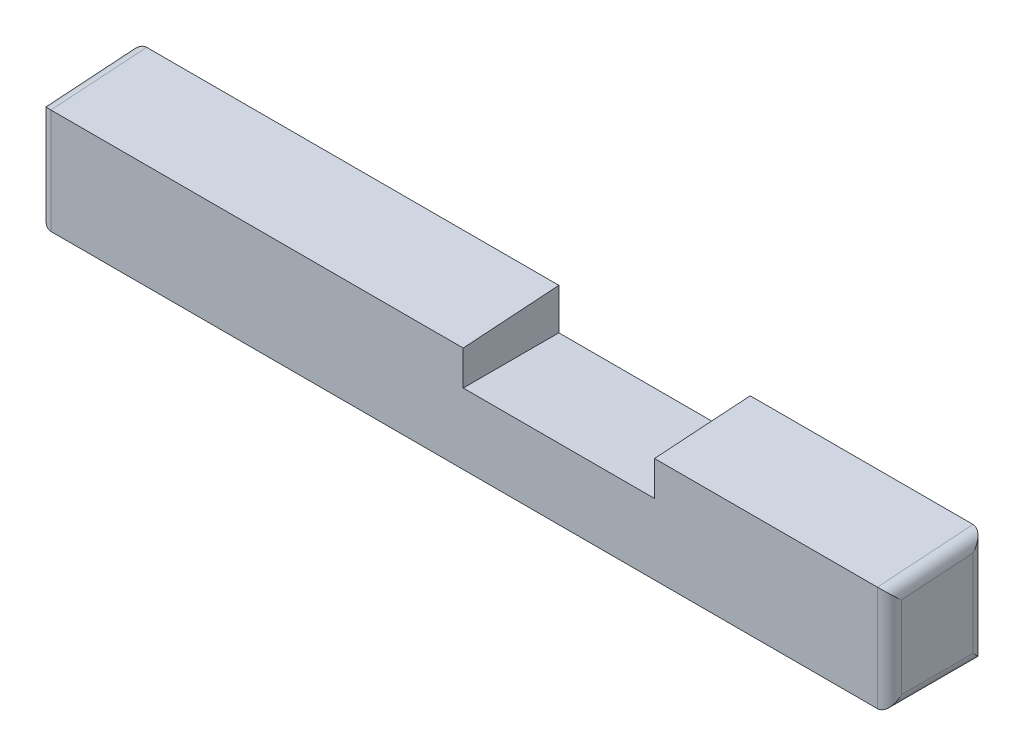
ISO-10303-21;
HEADER;
FILE_DESCRIPTION(('STEP AP214'),'2;1');
FILE_NAME('part.step','',(''),(''),'','','');
FILE_SCHEMA(('AUTOMOTIVE_DESIGN { 1 0 10303 214 1 1 1 1 }'));
ENDSEC;
DATA;
#1=APPLICATION_CONTEXT('core data for automotive mechanical design processes');
#2=APPLICATION_PROTOCOL_DEFINITION('international standard','automotive_design',2000,#1);
#3=PRODUCT_CONTEXT('',#1,'mechanical');
#4=PRODUCT('Part','Part','',(#3));
#5=PRODUCT_RELATED_PRODUCT_CATEGORY('part','',(#4));
#6=PRODUCT_DEFINITION_FORMATION('','',#4);
#7=PRODUCT_DEFINITION_CONTEXT('part definition',#1,'design');
#8=PRODUCT_DEFINITION('design','',#6,#7);
#9=PRODUCT_DEFINITION_SHAPE('','',#8);
#10=(LENGTH_UNIT() NAMED_UNIT(*) SI_UNIT(.MILLI.,.METRE.));
#11=(NAMED_UNIT(*) PLANE_ANGLE_UNIT() SI_UNIT($,.RADIAN.));
#12=(NAMED_UNIT(*) SI_UNIT($,.STERADIAN.) SOLID_ANGLE_UNIT());
#13=UNCERTAINTY_MEASURE_WITH_UNIT(LENGTH_MEASURE(1.E-05),#10,'distance_accuracy_value','');
#14=(GEOMETRIC_REPRESENTATION_CONTEXT(3) GLOBAL_UNCERTAINTY_ASSIGNED_CONTEXT((#13)) GLOBAL_UNIT_ASSIGNED_CONTEXT((#10,
#11,#12)) REPRESENTATION_CONTEXT('',''));
#15=CARTESIAN_POINT('',(0.,0.,0.));
#16=DIRECTION('',(0.,0.,1.));
#17=DIRECTION('',(1.,0.,0.));
#18=AXIS2_PLACEMENT_3D('',#15,#16,#17);
#19=CARTESIAN_POINT('',(9.25,-2.02621967336627,-1.87718698406525));
#20=DIRECTION('',(0.,-1.,0.));
#21=DIRECTION('',(0.,0.,-1.));
#22=AXIS2_PLACEMENT_3D('',#19,#20,#21);
#23=PLANE('',#22);
#24=DIRECTION('',(-1.,0.,0.));
#25=VECTOR('',#24,1.);
#26=CARTESIAN_POINT('',(9.25,-2.02621967336627,0.122813015934753));
#27=LINE('',#26,#25);
#28=CARTESIAN_POINT('',(9.,-2.02621967336627,0.122813015934753));
#29=VERTEX_POINT('',#28);
#30=CARTESIAN_POINT('',(-8.28,-2.02621967336627,0.122813015934753));
#31=VERTEX_POINT('',#30);
#32=EDGE_CURVE('E214',#29,#31,#27,.T.);
#33=ORIENTED_EDGE('',*,*,#32,.T.);
#34=DIRECTION('',(0.,0.,-1.));
#35=VECTOR('',#34,1.);
#36=CARTESIAN_POINT('',(-8.28,-2.02621967336627,-1.87718698406525));
#37=LINE('',#36,#35);
#38=CARTESIAN_POINT('',(-8.28,-2.02621967336627,-1.87718698406525));
#39=VERTEX_POINT('',#38);
#40=EDGE_CURVE('E246',#31,#39,#37,.T.);
#41=ORIENTED_EDGE('',*,*,#40,.T.);
#42=DIRECTION('',(-1.,0.,0.));
#43=VECTOR('',#42,1.);
#44=CARTESIAN_POINT('',(9.25,-2.02621967336627,-1.87718698406525));
#45=LINE('',#44,#43);
#46=CARTESIAN_POINT('',(9.,-2.02621967336627,-1.87718698406525));
#47=VERTEX_POINT('',#46);
#48=EDGE_CURVE('E218',#47,#39,#45,.T.);
#49=ORIENTED_EDGE('',*,*,#48,.F.);
#50=DIRECTION('',(0.,0.,1.));
#51=VECTOR('',#50,1.);
#52=CARTESIAN_POINT('',(9.,-2.02621967336627,-1.87718698406525));
#53=LINE('',#52,#51);
#54=EDGE_CURVE('E244',#47,#29,#53,.T.);
#55=ORIENTED_EDGE('',*,*,#54,.T.);
#56=EDGE_LOOP('',(#33,#41,#49,#55));
#57=FACE_BOUND('',#56,.T.);
#58=DIRECTION('',(1.,0.,0.));
#59=VECTOR('',#58,1.);
#60=CARTESIAN_POINT('',(-1.41,-2.02621967336627,-1.12718698406525));
#61=LINE('',#60,#59);
#62=CARTESIAN_POINT('',(-1.41,-2.02621967336627,-1.12718698406525));
#63=VERTEX_POINT('',#62);
#64=CARTESIAN_POINT('',(2.09,-2.02621967336627,-1.12718698406525));
#65=VERTEX_POINT('',#64);
#66=EDGE_CURVE('E164',#63,#65,#61,.T.);
#67=ORIENTED_EDGE('',*,*,#66,.F.);
#68=DIRECTION('',(0.,0.,-1.));
#69=VECTOR('',#68,1.);
#70=CARTESIAN_POINT('',(-1.41,-2.02621967336627,-0.627186984065249));
#71=LINE('',#70,#69);
#72=CARTESIAN_POINT('',(-1.41,-2.02621967336627,-0.627186984065249));
#73=VERTEX_POINT('',#72);
#74=EDGE_CURVE('E171',#73,#63,#71,.T.);
#75=ORIENTED_EDGE('',*,*,#74,.F.);
#76=DIRECTION('',(-1.,0.,0.));
#77=VECTOR('',#76,1.);
#78=CARTESIAN_POINT('',(-1.41,-2.02621967336627,-0.627186984065249));
#79=LINE('',#78,#77);
#80=CARTESIAN_POINT('',(2.09,-2.02621967336627,-0.627186984065247));
#81=VERTEX_POINT('',#80);
#82=EDGE_CURVE('E182',#81,#73,#79,.T.);
#83=ORIENTED_EDGE('',*,*,#82,.F.);
#84=DIRECTION('',(0.,0.,1.));
#85=VECTOR('',#84,1.);
#86=CARTESIAN_POINT('',(2.09,-2.02621967336627,-0.627186984065247));
#87=LINE('',#86,#85);
#88=EDGE_CURVE('E180',#65,#81,#87,.T.);
#89=ORIENTED_EDGE('',*,*,#88,.F.);
#90=EDGE_LOOP('',(#67,#75,#83,#89));
#91=FACE_BOUND('',#90,.T.);
#92=ADVANCED_FACE('F34',(#57,#91),#23,.T.);
#93=CARTESIAN_POINT('',(9.25,0.173780326633732,0.122813015934753));
#94=DIRECTION('',(0.,0.997699362573323,0.0677936716868575));
#95=DIRECTION('',(0.,-0.0677936716868575,0.997699362573323));
#96=AXIS2_PLACEMENT_3D('',#93,#94,#95);
#97=PLANE('',#96);
#98=DIRECTION('',(-1.,0.,0.));
#99=VECTOR('',#98,1.);
#100=CARTESIAN_POINT('',(9.25,0.309680326633733,-1.87718698406525));
#101=LINE('',#100,#99);
#102=CARTESIAN_POINT('',(0.339999999999998,0.309680326633733,-1.87718698406525));
#103=VERTEX_POINT('',#102);
#104=CARTESIAN_POINT('',(-8.28,0.309680326633733,-1.87718698406525));
#105=VERTEX_POINT('',#104);
#106=EDGE_CURVE('E223',#103,#105,#101,.T.);
#107=ORIENTED_EDGE('',*,*,#106,.T.);
#108=DIRECTION('',(0.,0.0677936716868575,-0.997699362573323));
#109=VECTOR('',#108,1.);
#110=CARTESIAN_POINT('',(-8.28,0.173780326633732,0.122813015934753));
#111=LINE('',#110,#109);
#112=CARTESIAN_POINT('',(-8.28,0.173780326633732,0.122813015934753));
#113=VERTEX_POINT('',#112);
#114=EDGE_CURVE('E252',#105,#113,#111,.F.);
#115=ORIENTED_EDGE('',*,*,#114,.T.);
#116=DIRECTION('',(-1.,0.,0.));
#117=VECTOR('',#116,1.);
#118=CARTESIAN_POINT('',(9.25,0.173780326633732,0.122813015934753));
#119=LINE('',#118,#117);
#120=CARTESIAN_POINT('',(0.339999999999998,0.173780326633732,0.122813015934753));
#121=VERTEX_POINT('',#120);
#122=EDGE_CURVE('E212',#121,#113,#119,.T.);
#123=ORIENTED_EDGE('',*,*,#122,.F.);
#124=DIRECTION('',(0.,-0.0677936716868575,0.997699362573323));
#125=VECTOR('',#124,1.);
#126=CARTESIAN_POINT('',(0.339999999999998,0.173780326633732,0.122813015934754));
#127=LINE('',#126,#125);
#128=EDGE_CURVE('E228',#103,#121,#127,.T.);
#129=ORIENTED_EDGE('',*,*,#128,.F.);
#130=EDGE_LOOP('',(#107,#115,#123,#129));
#131=FACE_BOUND('',#130,.T.);
#132=ADVANCED_FACE('F317',(#131),#97,.T.);
#133=CARTESIAN_POINT('',(9.25,-2.02621967336627,0.122813015934753));
#134=DIRECTION('',(0.,0.,1.));
#135=DIRECTION('',(1.,0.,0.));
#136=AXIS2_PLACEMENT_3D('',#133,#134,#135);
#137=PLANE('',#136);
#138=ORIENTED_EDGE('',*,*,#122,.T.);
#139=DIRECTION('',(0.,-1.,0.));
#140=VECTOR('',#139,1.);
#141=CARTESIAN_POINT('',(-8.27999999999999,-2.02621967336627,0.122813015934753));
#142=LINE('',#141,#140);
#143=EDGE_CURVE('E232',#113,#31,#142,.T.);
#144=ORIENTED_EDGE('',*,*,#143,.T.);
#145=ORIENTED_EDGE('',*,*,#32,.F.);
#146=DIRECTION('',(0.,1.,0.));
#147=VECTOR('',#146,1.);
#148=CARTESIAN_POINT('',(9.,-2.02621967336627,0.122813015934753));
#149=LINE('',#148,#147);
#150=CARTESIAN_POINT('',(9.,0.173780326633732,0.122813015934753));
#151=VERTEX_POINT('',#150);
#152=EDGE_CURVE('E230',#29,#151,#149,.T.);
#153=ORIENTED_EDGE('',*,*,#152,.T.);
#154=CARTESIAN_POINT('',(4.34,0.173780326633732,0.122813015934753));
#155=VERTEX_POINT('',#154);
#156=EDGE_CURVE('E224',#151,#155,#119,.T.);
#157=ORIENTED_EDGE('',*,*,#156,.T.);
#158=DIRECTION('',(0.,-1.,0.));
#159=VECTOR('',#158,1.);
#160=CARTESIAN_POINT('',(4.34,0.309680326633733,0.122813015934753));
#161=LINE('',#160,#159);
#162=CARTESIAN_POINT('',(4.34,-0.550319673366267,0.122813015934753));
#163=VERTEX_POINT('',#162);
#164=EDGE_CURVE('E193',#155,#163,#161,.T.);
#165=ORIENTED_EDGE('',*,*,#164,.T.);
#166=DIRECTION('',(-1.,0.,0.));
#167=VECTOR('',#166,1.);
#168=CARTESIAN_POINT('',(4.34,-0.550319673366267,0.122813015934753));
#169=LINE('',#168,#167);
#170=CARTESIAN_POINT('',(0.339999999999999,-0.550319673366267,0.122813015934753));
#171=VERTEX_POINT('',#170);
#172=EDGE_CURVE('E196',#163,#171,#169,.T.);
#173=ORIENTED_EDGE('',*,*,#172,.T.);
#174=DIRECTION('',(0.,1.,0.));
#175=VECTOR('',#174,1.);
#176=CARTESIAN_POINT('',(0.339999999999999,-0.550319673366267,0.122813015934753));
#177=LINE('',#176,#175);
#178=EDGE_CURVE('E200',#171,#121,#177,.T.);
#179=ORIENTED_EDGE('',*,*,#178,.T.);
#180=EDGE_LOOP('',(#138,#144,#145,#153,#157,#165,#173,#179));
#181=FACE_BOUND('',#180,.T.);
#182=ADVANCED_FACE('F323',(#181),#137,.T.);
#183=CARTESIAN_POINT('',(9.25,0.309680326633733,-1.87718698406525));
#184=DIRECTION('',(0.,0.,-1.));
#185=DIRECTION('',(0.,1.,0.));
#186=AXIS2_PLACEMENT_3D('',#183,#184,#185);
#187=PLANE('',#186);
#188=ORIENTED_EDGE('',*,*,#48,.T.);
#189=DIRECTION('',(0.,-1.,0.));
#190=VECTOR('',#189,1.);
#191=CARTESIAN_POINT('',(-8.28,0.309680326633733,-1.87718698406525));
#192=LINE('',#191,#190);
#193=EDGE_CURVE('E250',#39,#105,#192,.F.);
#194=ORIENTED_EDGE('',*,*,#193,.T.);
#195=ORIENTED_EDGE('',*,*,#106,.F.);
#196=DIRECTION('',(0.,1.,0.));
#197=VECTOR('',#196,1.);
#198=CARTESIAN_POINT('',(0.339999999999999,-0.550319673366267,-1.87718698406525));
#199=LINE('',#198,#197);
#200=CARTESIAN_POINT('',(0.339999999999999,-0.550319673366267,-1.87718698406525));
#201=VERTEX_POINT('',#200);
#202=EDGE_CURVE('E197',#201,#103,#199,.T.);
#203=ORIENTED_EDGE('',*,*,#202,.F.);
#204=DIRECTION('',(-1.,0.,0.));
#205=VECTOR('',#204,1.);
#206=CARTESIAN_POINT('',(4.34,-0.550319673366267,-1.87718698406525));
#207=LINE('',#206,#205);
#208=CARTESIAN_POINT('',(4.34,-0.550319673366267,-1.87718698406525));
#209=VERTEX_POINT('',#208);
#210=EDGE_CURVE('E206',#209,#201,#207,.T.);
#211=ORIENTED_EDGE('',*,*,#210,.F.);
#212=DIRECTION('',(0.,-1.,0.));
#213=VECTOR('',#212,1.);
#214=CARTESIAN_POINT('',(4.34,0.309680326633733,-1.87718698406525));
#215=LINE('',#214,#213);
#216=CARTESIAN_POINT('',(4.34,0.309680326633733,-1.87718698406525));
#217=VERTEX_POINT('',#216);
#218=EDGE_CURVE('E167',#217,#209,#215,.T.);
#219=ORIENTED_EDGE('',*,*,#218,.F.);
#220=CARTESIAN_POINT('',(9.,0.309680326633733,-1.87718698406525));
#221=VERTEX_POINT('',#220);
#222=EDGE_CURVE('E221',#221,#217,#101,.T.);
#223=ORIENTED_EDGE('',*,*,#222,.F.);
#224=DIRECTION('',(0.,-1.,0.));
#225=VECTOR('',#224,1.);
#226=CARTESIAN_POINT('',(9.,0.309680326633733,-1.87718698406525));
#227=LINE('',#226,#225);
#228=EDGE_CURVE('E248',#221,#47,#227,.T.);
#229=ORIENTED_EDGE('',*,*,#228,.T.);
#230=EDGE_LOOP('',(#188,#194,#195,#203,#211,#219,#223,#229));
#231=FACE_BOUND('',#230,.T.);
#232=ADVANCED_FACE('F331',(#231),#187,.T.);
#233=ORIENTED_EDGE('',*,*,#156,.F.);
#234=DIRECTION('',(0.,0.0677936716868575,-0.997699362573323));
#235=VECTOR('',#234,1.);
#236=CARTESIAN_POINT('',(9.,0.173780326633732,0.122813015934753));
#237=LINE('',#236,#235);
#238=EDGE_CURVE('E254',#151,#221,#237,.T.);
#239=ORIENTED_EDGE('',*,*,#238,.T.);
#240=ORIENTED_EDGE('',*,*,#222,.T.);
#241=DIRECTION('',(0.,0.0677936716868575,-0.997699362573323));
#242=VECTOR('',#241,1.);
#243=CARTESIAN_POINT('',(4.34,0.173780326633732,0.122813015934753));
#244=LINE('',#243,#242);
#245=EDGE_CURVE('E217',#155,#217,#244,.T.);
#246=ORIENTED_EDGE('',*,*,#245,.F.);
#247=EDGE_LOOP('',(#233,#239,#240,#246));
#248=FACE_BOUND('',#247,.T.);
#249=ADVANCED_FACE('F326',(#248),#97,.T.);
#250=CARTESIAN_POINT('',(9.25,0.,0.));
#251=DIRECTION('',(1.,0.,0.));
#252=DIRECTION('',(0.,0.,-1.));
#253=AXIS2_PLACEMENT_3D('',#250,#251,#252);
#254=PLANE('',#253);
#255=DIRECTION('',(0.,-1.,0.));
#256=VECTOR('',#255,1.);
#257=CARTESIAN_POINT('',(9.25,0.,-1.62718698406525));
#258=LINE('',#257,#256);
#259=CARTESIAN_POINT('',(9.25,-1.77621967336627,-1.62718698406525));
#260=VERTEX_POINT('',#259);
#261=CARTESIAN_POINT('',(9.25,0.0421163409926215,-1.62718698406525));
#262=VERTEX_POINT('',#261);
#263=EDGE_CURVE('E261',#260,#262,#258,.F.);
#264=ORIENTED_EDGE('',*,*,#263,.T.);
#265=DIRECTION('',(0.,0.0677936716868575,-0.997699362573323));
#266=VECTOR('',#265,1.);
#267=CARTESIAN_POINT('',(9.25,-0.0681364149491681,-0.00462986939579598));
#268=LINE('',#267,#266);
#269=CARTESIAN_POINT('',(9.25,-0.0598086590073788,-0.127186984065247));
#270=VERTEX_POINT('',#269);
#271=EDGE_CURVE('E263',#262,#270,#268,.F.);
#272=ORIENTED_EDGE('',*,*,#271,.T.);
#273=DIRECTION('',(0.,1.,0.));
#274=VECTOR('',#273,1.);
#275=CARTESIAN_POINT('',(9.25,0.,-0.127186984065247));
#276=LINE('',#275,#274);
#277=CARTESIAN_POINT('',(9.25,-1.77621967336627,-0.127186984065247));
#278=VERTEX_POINT('',#277);
#279=EDGE_CURVE('E257',#270,#278,#276,.F.);
#280=ORIENTED_EDGE('',*,*,#279,.T.);
#281=DIRECTION('',(0.,0.,1.));
#282=VECTOR('',#281,1.);
#283=CARTESIAN_POINT('',(9.25,-1.77621967336627,0.));
#284=LINE('',#283,#282);
#285=EDGE_CURVE('E259',#278,#260,#284,.F.);
#286=ORIENTED_EDGE('',*,*,#285,.T.);
#287=EDGE_LOOP('',(#264,#272,#280,#286));
#288=FACE_BOUND('',#287,.T.);
#289=ADVANCED_FACE('F329',(#288),#254,.T.);
#290=CARTESIAN_POINT('',(0.339999999999999,-0.550319673366267,0.122813015934753));
#291=DIRECTION('',(-1.,0.,0.));
#292=DIRECTION('',(0.,-1.,0.));
#293=AXIS2_PLACEMENT_3D('',#290,#291,#292);
#294=PLANE('',#293);
#295=ORIENTED_EDGE('',*,*,#128,.T.);
#296=ORIENTED_EDGE('',*,*,#178,.F.);
#297=DIRECTION('',(0.,0.,-1.));
#298=VECTOR('',#297,1.);
#299=CARTESIAN_POINT('',(0.339999999999999,-0.550319673366267,0.122813015934753));
#300=LINE('',#299,#298);
#301=EDGE_CURVE('E210',#171,#201,#300,.T.);
#302=ORIENTED_EDGE('',*,*,#301,.T.);
#303=ORIENTED_EDGE('',*,*,#202,.T.);
#304=EDGE_LOOP('',(#295,#296,#302,#303));
#305=FACE_BOUND('',#304,.T.);
#306=ADVANCED_FACE('F432',(#305),#294,.F.);
#307=CARTESIAN_POINT('',(4.34,-0.550319673366267,0.122813015934753));
#308=DIRECTION('',(0.,-1.,0.));
#309=DIRECTION('',(0.,0.,-1.));
#310=AXIS2_PLACEMENT_3D('',#307,#308,#309);
#311=PLANE('',#310);
#312=ORIENTED_EDGE('',*,*,#210,.T.);
#313=ORIENTED_EDGE('',*,*,#301,.F.);
#314=ORIENTED_EDGE('',*,*,#172,.F.);
#315=DIRECTION('',(0.,0.,-1.));
#316=VECTOR('',#315,1.);
#317=CARTESIAN_POINT('',(4.34,-0.550319673366267,0.122813015934753));
#318=LINE('',#317,#316);
#319=EDGE_CURVE('E203',#163,#209,#318,.T.);
#320=ORIENTED_EDGE('',*,*,#319,.T.);
#321=EDGE_LOOP('',(#312,#313,#314,#320));
#322=FACE_BOUND('',#321,.T.);
#323=ADVANCED_FACE('F394',(#322),#311,.F.);
#324=CARTESIAN_POINT('',(4.34,0.309680326633733,0.122813015934753));
#325=DIRECTION('',(1.,0.,0.));
#326=DIRECTION('',(0.,0.,-1.));
#327=AXIS2_PLACEMENT_3D('',#324,#325,#326);
#328=PLANE('',#327);
#329=ORIENTED_EDGE('',*,*,#245,.T.);
#330=ORIENTED_EDGE('',*,*,#218,.T.);
#331=ORIENTED_EDGE('',*,*,#319,.F.);
#332=ORIENTED_EDGE('',*,*,#164,.F.);
#333=EDGE_LOOP('',(#329,#330,#331,#332));
#334=FACE_BOUND('',#333,.T.);
#335=ADVANCED_FACE('F389',(#334),#328,.F.);
#336=CARTESIAN_POINT('',(-1.41,-2.52621967336627,-0.627186984065249));
#337=DIRECTION('',(1.,0.,0.));
#338=DIRECTION('',(0.,0.,-1.));
#339=AXIS2_PLACEMENT_3D('',#336,#337,#338);
#340=PLANE('',#339);
#341=DIRECTION('',(0.,1.,0.));
#342=VECTOR('',#341,1.);
#343=CARTESIAN_POINT('',(-1.41,-2.52621967336627,-1.12718698406525));
#344=LINE('',#343,#342);
#345=CARTESIAN_POINT('',(-1.41,-2.42621967336627,-1.12718698406525));
#346=VERTEX_POINT('',#345);
#347=EDGE_CURVE('E158',#346,#63,#344,.T.);
#348=ORIENTED_EDGE('',*,*,#347,.F.);
#349=DIRECTION('',(0.,0.,-1.));
#350=VECTOR('',#349,1.);
#351=CARTESIAN_POINT('',(-1.41,-2.42621967336627,-0.627186984065249));
#352=LINE('',#351,#350);
#353=CARTESIAN_POINT('',(-1.41,-2.42621967336627,-0.627186984065249));
#354=VERTEX_POINT('',#353);
#355=EDGE_CURVE('E57',#346,#354,#352,.F.);
#356=ORIENTED_EDGE('',*,*,#355,.T.);
#357=DIRECTION('',(0.,1.,0.));
#358=VECTOR('',#357,1.);
#359=CARTESIAN_POINT('',(-1.41,-2.52621967336627,-0.627186984065249));
#360=LINE('',#359,#358);
#361=EDGE_CURVE('E173',#354,#73,#360,.T.);
#362=ORIENTED_EDGE('',*,*,#361,.T.);
#363=ORIENTED_EDGE('',*,*,#74,.T.);
#364=EDGE_LOOP('',(#348,#356,#362,#363));
#365=FACE_BOUND('',#364,.T.);
#366=ADVANCED_FACE('F172',(#365),#340,.F.);
#367=CARTESIAN_POINT('',(-1.41,-2.52621967336627,-1.12718698406525));
#368=DIRECTION('',(0.,0.,1.));
#369=DIRECTION('',(0.,-1.,0.));
#370=AXIS2_PLACEMENT_3D('',#367,#368,#369);
#371=PLANE('',#370);
#372=DIRECTION('',(1.,0.,0.));
#373=VECTOR('',#372,1.);
#374=CARTESIAN_POINT('',(-1.41,-2.52621967336627,-1.12718698406525));
#375=LINE('',#374,#373);
#376=CARTESIAN_POINT('',(-1.31,-2.52621967336627,-1.12718698406525));
#377=VERTEX_POINT('',#376);
#378=CARTESIAN_POINT('',(1.99,-2.52621967336627,-1.12718698406525));
#379=VERTEX_POINT('',#378);
#380=EDGE_CURVE('E187',#377,#379,#375,.T.);
#381=ORIENTED_EDGE('',*,*,#380,.F.);
#382=CARTESIAN_POINT('',(-1.31,-2.42621967336627,-1.12718698406525));
#383=DIRECTION('',(0.,0.,1.));
#384=DIRECTION('',(0.,-1.,0.));
#385=AXIS2_PLACEMENT_3D('',#382,#383,#384);
#386=CIRCLE('',#385,0.1);
#387=EDGE_CURVE('E166',#377,#346,#386,.F.);
#388=ORIENTED_EDGE('',*,*,#387,.T.);
#389=ORIENTED_EDGE('',*,*,#347,.T.);
#390=ORIENTED_EDGE('',*,*,#66,.T.);
#391=DIRECTION('',(0.,1.,0.));
#392=VECTOR('',#391,1.);
#393=CARTESIAN_POINT('',(2.09,-2.52621967336627,-1.12718698406525));
#394=LINE('',#393,#392);
#395=CARTESIAN_POINT('',(2.09,-2.42621967336627,-1.12718698406525));
#396=VERTEX_POINT('',#395);
#397=EDGE_CURVE('E168',#396,#65,#394,.T.);
#398=ORIENTED_EDGE('',*,*,#397,.F.);
#399=CARTESIAN_POINT('',(1.99,-2.42621967336627,-1.12718698406525));
#400=DIRECTION('',(0.,0.,1.));
#401=DIRECTION('',(0.,-1.,0.));
#402=AXIS2_PLACEMENT_3D('',#399,#400,#401);
#403=CIRCLE('',#402,0.1);
#404=EDGE_CURVE('E291',#396,#379,#403,.F.);
#405=ORIENTED_EDGE('',*,*,#404,.T.);
#406=EDGE_LOOP('',(#381,#388,#389,#390,#398,#405));
#407=FACE_BOUND('',#406,.T.);
#408=ADVANCED_FACE('F161',(#407),#371,.F.);
#409=CARTESIAN_POINT('',(2.09,-2.52621967336627,-0.627186984065247));
#410=DIRECTION('',(-1.,0.,0.));
#411=DIRECTION('',(0.,0.,1.));
#412=AXIS2_PLACEMENT_3D('',#409,#410,#411);
#413=PLANE('',#412);
#414=DIRECTION('',(0.,1.,0.));
#415=VECTOR('',#414,1.);
#416=CARTESIAN_POINT('',(2.09,-2.52621967336627,-0.627186984065247));
#417=LINE('',#416,#415);
#418=CARTESIAN_POINT('',(2.09,-2.42621967336627,-0.627186984065247));
#419=VERTEX_POINT('',#418);
#420=EDGE_CURVE('E189',#419,#81,#417,.T.);
#421=ORIENTED_EDGE('',*,*,#420,.F.);
#422=DIRECTION('',(0.,0.,1.));
#423=VECTOR('',#422,1.);
#424=CARTESIAN_POINT('',(2.09,-2.42621967336627,-1.12718698406525));
#425=LINE('',#424,#423);
#426=EDGE_CURVE('E11',#419,#396,#425,.F.);
#427=ORIENTED_EDGE('',*,*,#426,.T.);
#428=ORIENTED_EDGE('',*,*,#397,.T.);
#429=ORIENTED_EDGE('',*,*,#88,.T.);
#430=EDGE_LOOP('',(#421,#427,#428,#429));
#431=FACE_BOUND('',#430,.T.);
#432=ADVANCED_FACE('F424',(#431),#413,.F.);
#433=CARTESIAN_POINT('',(-1.41,-2.52621967336627,-0.627186984065249));
#434=DIRECTION('',(0.,0.,-1.));
#435=DIRECTION('',(-1.,0.,0.));
#436=AXIS2_PLACEMENT_3D('',#433,#434,#435);
#437=PLANE('',#436);
#438=ORIENTED_EDGE('',*,*,#361,.F.);
#439=CARTESIAN_POINT('',(-1.31,-2.42621967336627,-0.627186984065249));
#440=DIRECTION('',(0.,0.,-1.));
#441=DIRECTION('',(-1.,0.,0.));
#442=AXIS2_PLACEMENT_3D('',#439,#440,#441);
#443=CIRCLE('',#442,0.1);
#444=CARTESIAN_POINT('',(-1.31,-2.52621967336627,-0.627186984065249));
#445=VERTEX_POINT('',#444);
#446=EDGE_CURVE('E42',#354,#445,#443,.F.);
#447=ORIENTED_EDGE('',*,*,#446,.T.);
#448=DIRECTION('',(-1.,0.,0.));
#449=VECTOR('',#448,1.);
#450=CARTESIAN_POINT('',(-1.41,-2.52621967336627,-0.627186984065249));
#451=LINE('',#450,#449);
#452=CARTESIAN_POINT('',(1.99,-2.52621967336627,-0.627186984065247));
#453=VERTEX_POINT('',#452);
#454=EDGE_CURVE('E190',#453,#445,#451,.T.);
#455=ORIENTED_EDGE('',*,*,#454,.F.);
#456=CARTESIAN_POINT('',(1.99,-2.42621967336627,-0.627186984065247));
#457=DIRECTION('',(0.,0.,-1.));
#458=DIRECTION('',(-1.,0.,0.));
#459=AXIS2_PLACEMENT_3D('',#456,#457,#458);
#460=CIRCLE('',#459,0.1);
#461=EDGE_CURVE('E49',#453,#419,#460,.F.);
#462=ORIENTED_EDGE('',*,*,#461,.T.);
#463=ORIENTED_EDGE('',*,*,#420,.T.);
#464=ORIENTED_EDGE('',*,*,#82,.T.);
#465=EDGE_LOOP('',(#438,#447,#455,#462,#463,#464));
#466=FACE_BOUND('',#465,.T.);
#467=ADVANCED_FACE('F297',(#466),#437,.F.);
#468=CARTESIAN_POINT('',(0.,-2.52621967336627,0.));
#469=DIRECTION('',(0.,-1.,0.));
#470=DIRECTION('',(0.,0.,-1.));
#471=AXIS2_PLACEMENT_3D('',#468,#469,#470);
#472=PLANE('',#471);
#473=ORIENTED_EDGE('',*,*,#454,.T.);
#474=DIRECTION('',(0.,0.,-1.));
#475=VECTOR('',#474,1.);
#476=CARTESIAN_POINT('',(-1.31,-2.52621967336627,-1.12718698406525));
#477=LINE('',#476,#475);
#478=EDGE_CURVE('E288',#445,#377,#477,.T.);
#479=ORIENTED_EDGE('',*,*,#478,.T.);
#480=ORIENTED_EDGE('',*,*,#380,.T.);
#481=DIRECTION('',(0.,0.,1.));
#482=VECTOR('',#481,1.);
#483=CARTESIAN_POINT('',(1.99,-2.52621967336627,-0.627186984065247));
#484=LINE('',#483,#482);
#485=EDGE_CURVE('E266',#379,#453,#484,.T.);
#486=ORIENTED_EDGE('',*,*,#485,.T.);
#487=EDGE_LOOP('',(#473,#479,#480,#486));
#488=FACE_BOUND('',#487,.T.);
#489=ADVANCED_FACE('F301',(#488),#472,.T.);
#490=CARTESIAN_POINT('',(-8.53,0.309680326633732,0.122813015934753));
#491=DIRECTION('',(1.,0.,0.));
#492=DIRECTION('',(0.,1.,0.));
#493=AXIS2_PLACEMENT_3D('',#490,#491,#492);
#494=PLANE('',#493);
#495=DIRECTION('',(0.,0.,-1.));
#496=VECTOR('',#495,1.);
#497=CARTESIAN_POINT('',(-8.53,-1.77621967336627,0.122813015934753));
#498=LINE('',#497,#496);
#499=CARTESIAN_POINT('',(-8.53,-1.77621967336627,-1.62718698406525));
#500=VERTEX_POINT('',#499);
#501=CARTESIAN_POINT('',(-8.53,-1.77621967336627,-0.127186984065247));
#502=VERTEX_POINT('',#501);
#503=EDGE_CURVE('E239',#500,#502,#498,.F.);
#504=ORIENTED_EDGE('',*,*,#503,.T.);
#505=DIRECTION('',(0.,-1.,0.));
#506=VECTOR('',#505,1.);
#507=CARTESIAN_POINT('',(-8.53,0.173780326633732,-0.127186984065247));
#508=LINE('',#507,#506);
#509=CARTESIAN_POINT('',(-8.53,-0.059808659007379,-0.127186984065247));
#510=VERTEX_POINT('',#509);
#511=EDGE_CURVE('E241',#502,#510,#508,.F.);
#512=ORIENTED_EDGE('',*,*,#511,.T.);
#513=DIRECTION('',(0.,0.0677936716868575,-0.997699362573323));
#514=VECTOR('',#513,1.);
#515=CARTESIAN_POINT('',(-8.53,0.0602554859904019,-1.89413540198696));
#516=LINE('',#515,#514);
#517=CARTESIAN_POINT('',(-8.53,0.0421163409926213,-1.62718698406525));
#518=VERTEX_POINT('',#517);
#519=EDGE_CURVE('E235',#510,#518,#516,.T.);
#520=ORIENTED_EDGE('',*,*,#519,.T.);
#521=DIRECTION('',(0.,-1.,0.));
#522=VECTOR('',#521,1.);
#523=CARTESIAN_POINT('',(-8.53,-2.02621967336627,-1.62718698406525));
#524=LINE('',#523,#522);
#525=EDGE_CURVE('E237',#518,#500,#524,.T.);
#526=ORIENTED_EDGE('',*,*,#525,.T.);
#527=EDGE_LOOP('',(#504,#512,#520,#526));
#528=FACE_BOUND('',#527,.T.);
#529=ADVANCED_FACE('F355',(#528),#494,.F.);
#530=CARTESIAN_POINT('',(-8.28,0.309680326633733,-1.62718698406525));
#531=DIRECTION('',(0.,1.,0.));
#532=DIRECTION('',(-1.,0.,0.));
#533=AXIS2_PLACEMENT_3D('',#530,#531,#532);
#534=CYLINDRICAL_SURFACE('',#533,0.25);
#535=CARTESIAN_POINT('',(-8.28,-1.77621967336627,-1.62718698406525));
#536=DIRECTION('',(0.,0.707106781186548,-0.707106781186547));
#537=DIRECTION('',(0.,0.707106781186547,0.707106781186548));
#538=AXIS2_PLACEMENT_3D('',#535,#536,#537);
#539=ELLIPSE('',#538,0.353553390593274,0.25);
#540=EDGE_CURVE('E272',#500,#39,#539,.F.);
#541=ORIENTED_EDGE('',*,*,#540,.F.);
#542=ORIENTED_EDGE('',*,*,#525,.F.);
#543=CARTESIAN_POINT('',(-8.28,0.0421163409926215,-1.62718698406525));
#544=DIRECTION('',(0.,0.682717484876849,0.7306824452821));
#545=DIRECTION('',(0.,-0.7306824452821,0.682717484876849));
#546=AXIS2_PLACEMENT_3D('',#543,#544,#545);
#547=ELLIPSE('',#546,0.366183678516884,0.25);
#548=EDGE_CURVE('E177',#105,#518,#547,.T.);
#549=ORIENTED_EDGE('',*,*,#548,.F.);
#550=ORIENTED_EDGE('',*,*,#193,.F.);
#551=EDGE_LOOP('',(#541,#542,#549,#550));
#552=FACE_BOUND('',#551,.T.);
#553=ADVANCED_FACE('F352',(#552),#534,.T.);
#554=CARTESIAN_POINT('',(-8.28,-0.0750199200665636,0.0966726341714679));
#555=DIRECTION('',(0.,-0.0677936716868575,0.997699362573323));
#556=DIRECTION('',(0.,-0.997699362573323,-0.0677936716868575));
#557=AXIS2_PLACEMENT_3D('',#554,#555,#556);
#558=CYLINDRICAL_SURFACE('',#557,0.25);
#559=ORIENTED_EDGE('',*,*,#548,.T.);
#560=ORIENTED_EDGE('',*,*,#519,.F.);
#561=CARTESIAN_POINT('',(-8.28,-0.0598086590073788,-0.127186984065247));
#562=DIRECTION('',(0.,-0.7306824452821,0.68271748487685));
#563=DIRECTION('',(0.,0.682717484876849,0.7306824452821));
#564=AXIS2_PLACEMENT_3D('',#561,#562,#563);
#565=ELLIPSE('',#564,0.342145896092359,0.25);
#566=EDGE_CURVE('E269',#113,#510,#565,.T.);
#567=ORIENTED_EDGE('',*,*,#566,.F.);
#568=ORIENTED_EDGE('',*,*,#114,.F.);
#569=EDGE_LOOP('',(#559,#560,#567,#568));
#570=FACE_BOUND('',#569,.T.);
#571=ADVANCED_FACE('F348',(#570),#558,.T.);
#572=CARTESIAN_POINT('',(-8.28,-1.77621967336627,-1.87718698406525));
#573=DIRECTION('',(0.,0.,1.));
#574=DIRECTION('',(0.,-1.,0.));
#575=AXIS2_PLACEMENT_3D('',#572,#573,#574);
#576=CYLINDRICAL_SURFACE('',#575,0.25);
#577=ORIENTED_EDGE('',*,*,#540,.T.);
#578=ORIENTED_EDGE('',*,*,#40,.F.);
#579=CARTESIAN_POINT('',(-8.28,-1.77621967336627,-0.127186984065247));
#580=DIRECTION('',(0.,0.707106781186547,0.707106781186548));
#581=DIRECTION('',(0.,-0.707106781186548,0.707106781186547));
#582=AXIS2_PLACEMENT_3D('',#579,#580,#581);
#583=ELLIPSE('',#582,0.353553390593274,0.25);
#584=EDGE_CURVE('E267',#502,#31,#583,.T.);
#585=ORIENTED_EDGE('',*,*,#584,.F.);
#586=ORIENTED_EDGE('',*,*,#503,.F.);
#587=EDGE_LOOP('',(#577,#578,#585,#586));
#588=FACE_BOUND('',#587,.T.);
#589=ADVANCED_FACE('F344',(#588),#576,.T.);
#590=CARTESIAN_POINT('',(-8.27999999999999,-2.02621967336628,-0.127186984065247));
#591=DIRECTION('',(0.,1.,0.));
#592=DIRECTION('',(-1.,0.,0.));
#593=AXIS2_PLACEMENT_3D('',#590,#591,#592);
#594=CYLINDRICAL_SURFACE('',#593,0.25);
#595=ORIENTED_EDGE('',*,*,#566,.T.);
#596=ORIENTED_EDGE('',*,*,#511,.F.);
#597=ORIENTED_EDGE('',*,*,#584,.T.);
#598=ORIENTED_EDGE('',*,*,#143,.F.);
#599=EDGE_LOOP('',(#595,#596,#597,#598));
#600=FACE_BOUND('',#599,.T.);
#601=ADVANCED_FACE('F340',(#600),#594,.T.);
#602=CARTESIAN_POINT('',(9.,-1.77621967336627,-1.87718698406525));
#603=DIRECTION('',(0.,0.,1.));
#604=DIRECTION('',(0.,-1.,0.));
#605=AXIS2_PLACEMENT_3D('',#602,#603,#604);
#606=CYLINDRICAL_SURFACE('',#605,0.25);
#607=CARTESIAN_POINT('',(9.,-1.77621967336627,-1.62718698406525));
#608=DIRECTION('',(0.,-0.707106781186548,0.707106781186547));
#609=DIRECTION('',(0.,0.707106781186547,0.707106781186548));
#610=AXIS2_PLACEMENT_3D('',#607,#608,#609);
#611=ELLIPSE('',#610,0.353553390593274,0.25);
#612=EDGE_CURVE('E281',#260,#47,#611,.F.);
#613=ORIENTED_EDGE('',*,*,#612,.F.);
#614=ORIENTED_EDGE('',*,*,#285,.F.);
#615=CARTESIAN_POINT('',(9.,-1.77621967336627,-0.127186984065247));
#616=DIRECTION('',(0.,0.707106781186547,0.707106781186548));
#617=DIRECTION('',(0.,0.707106781186548,-0.707106781186547));
#618=AXIS2_PLACEMENT_3D('',#615,#616,#617);
#619=ELLIPSE('',#618,0.353553390593274,0.25);
#620=EDGE_CURVE('E270',#29,#278,#619,.T.);
#621=ORIENTED_EDGE('',*,*,#620,.F.);
#622=ORIENTED_EDGE('',*,*,#54,.F.);
#623=EDGE_LOOP('',(#613,#614,#621,#622));
#624=FACE_BOUND('',#623,.T.);
#625=ADVANCED_FACE('F343',(#624),#606,.T.);
#626=CARTESIAN_POINT('',(9.,-2.02621967336627,-0.127186984065247));
#627=DIRECTION('',(0.,1.,0.));
#628=DIRECTION('',(0.,0.,1.));
#629=AXIS2_PLACEMENT_3D('',#626,#627,#628);
#630=CYLINDRICAL_SURFACE('',#629,0.25);
#631=ORIENTED_EDGE('',*,*,#620,.T.);
#632=ORIENTED_EDGE('',*,*,#279,.F.);
#633=CARTESIAN_POINT('',(9.,-0.059808659007379,-0.127186984065247));
#634=DIRECTION('',(0.,0.7306824452821,-0.68271748487685));
#635=DIRECTION('',(0.,0.682717484876849,0.7306824452821));
#636=AXIS2_PLACEMENT_3D('',#633,#634,#635);
#637=ELLIPSE('',#636,0.342145896092359,0.25);
#638=EDGE_CURVE('E279',#151,#270,#637,.T.);
#639=ORIENTED_EDGE('',*,*,#638,.F.);
#640=ORIENTED_EDGE('',*,*,#152,.F.);
#641=EDGE_LOOP('',(#631,#632,#639,#640));
#642=FACE_BOUND('',#641,.T.);
#643=ADVANCED_FACE('F360',(#642),#630,.T.);
#644=CARTESIAN_POINT('',(9.,0.309680326633733,-1.62718698406525));
#645=DIRECTION('',(0.,-1.,0.));
#646=DIRECTION('',(0.,0.,-1.));
#647=AXIS2_PLACEMENT_3D('',#644,#645,#646);
#648=CYLINDRICAL_SURFACE('',#647,0.25);
#649=ORIENTED_EDGE('',*,*,#612,.T.);
#650=ORIENTED_EDGE('',*,*,#228,.F.);
#651=CARTESIAN_POINT('',(9.,0.0421163409926215,-1.62718698406525));
#652=DIRECTION('',(0.,-0.682717484876849,-0.7306824452821));
#653=DIRECTION('',(0.,-0.7306824452821,0.682717484876849));
#654=AXIS2_PLACEMENT_3D('',#651,#652,#653);
#655=ELLIPSE('',#654,0.366183678516884,0.25);
#656=EDGE_CURVE('E277',#262,#221,#655,.F.);
#657=ORIENTED_EDGE('',*,*,#656,.F.);
#658=ORIENTED_EDGE('',*,*,#263,.F.);
#659=EDGE_LOOP('',(#649,#650,#657,#658));
#660=FACE_BOUND('',#659,.T.);
#661=ADVANCED_FACE('F312',(#660),#648,.T.);
#662=CARTESIAN_POINT('',(9.,-0.0756445140095984,0.105864598013039));
#663=DIRECTION('',(0.,0.0677936716868575,-0.997699362573323));
#664=DIRECTION('',(0.,0.997699362573323,0.0677936716868575));
#665=AXIS2_PLACEMENT_3D('',#662,#663,#664);
#666=CYLINDRICAL_SURFACE('',#665,0.25);
#667=ORIENTED_EDGE('',*,*,#638,.T.);
#668=ORIENTED_EDGE('',*,*,#271,.F.);
#669=ORIENTED_EDGE('',*,*,#656,.T.);
#670=ORIENTED_EDGE('',*,*,#238,.F.);
#671=EDGE_LOOP('',(#667,#668,#669,#670));
#672=FACE_BOUND('',#671,.T.);
#673=ADVANCED_FACE('F306',(#672),#666,.T.);
#674=CARTESIAN_POINT('',(-1.31,-2.42621967336627,0.));
#675=DIRECTION('',(0.,0.,1.));
#676=DIRECTION('',(0.,-1.,0.));
#677=AXIS2_PLACEMENT_3D('',#674,#675,#676);
#678=CYLINDRICAL_SURFACE('',#677,0.1);
#679=ORIENTED_EDGE('',*,*,#446,.F.);
#680=ORIENTED_EDGE('',*,*,#355,.F.);
#681=ORIENTED_EDGE('',*,*,#387,.F.);
#682=ORIENTED_EDGE('',*,*,#478,.F.);
#683=EDGE_LOOP('',(#679,#680,#681,#682));
#684=FACE_BOUND('',#683,.T.);
#685=ADVANCED_FACE('F304',(#684),#678,.T.);
#686=CARTESIAN_POINT('',(1.99,-2.42621967336627,0.));
#687=DIRECTION('',(0.,0.,-1.));
#688=DIRECTION('',(0.,1.,0.));
#689=AXIS2_PLACEMENT_3D('',#686,#687,#688);
#690=CYLINDRICAL_SURFACE('',#689,0.1);
#691=ORIENTED_EDGE('',*,*,#404,.F.);
#692=ORIENTED_EDGE('',*,*,#426,.F.);
#693=ORIENTED_EDGE('',*,*,#461,.F.);
#694=ORIENTED_EDGE('',*,*,#485,.F.);
#695=EDGE_LOOP('',(#691,#692,#693,#694));
#696=FACE_BOUND('',#695,.T.);
#697=ADVANCED_FACE('F36',(#696),#690,.T.);
#698=CLOSED_SHELL('',(#92,#132,#182,#232,#249,#289,#306,#323,#335,#366,#408,#432,#467,#489,#529,
#553,#571,#589,#601,#625,#643,#661,#673,#685,#697));
#699=MANIFOLD_SOLID_BREP('B2',#698);
#700=ADVANCED_BREP_SHAPE_REPRESENTATION('',(#18,#699),#14);
#701=SHAPE_DEFINITION_REPRESENTATION(#9,#700);
ENDSEC;
END-ISO-10303-21;
